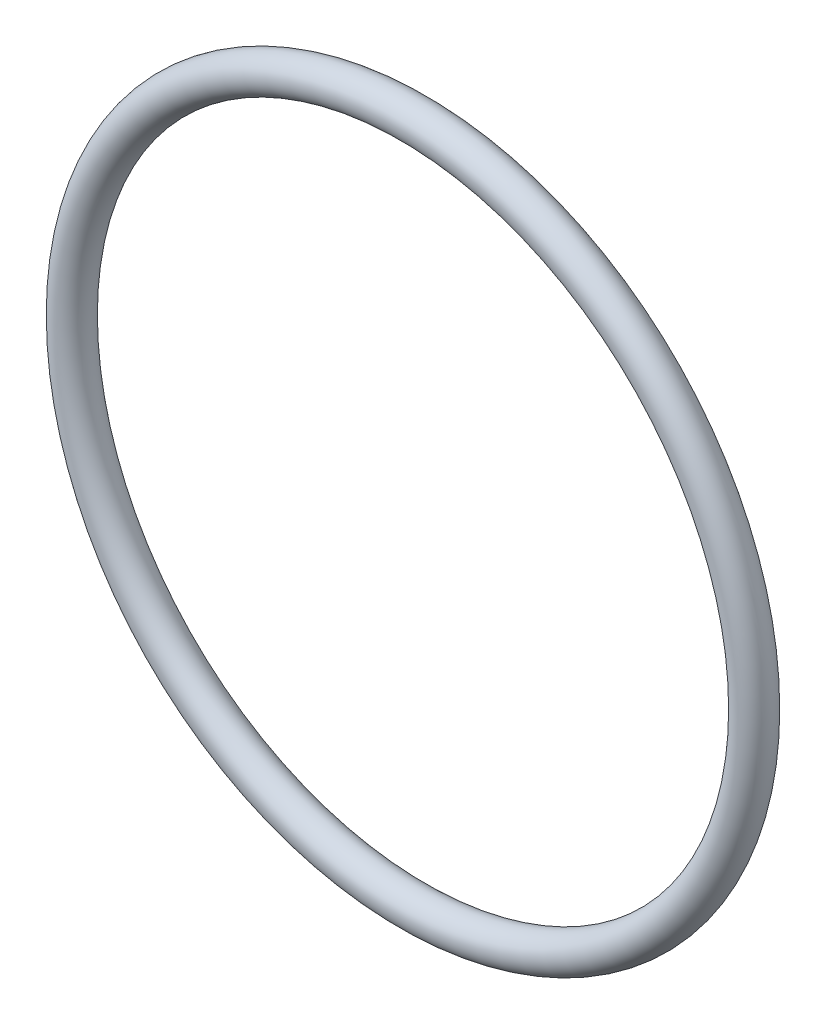
ISO-10303-21;
HEADER;
FILE_DESCRIPTION(('STEP AP214'),'2;1');
FILE_NAME('part.step','',(''),(''),'','','');
FILE_SCHEMA(('AUTOMOTIVE_DESIGN { 1 0 10303 214 1 1 1 1 }'));
ENDSEC;
DATA;
#1=APPLICATION_CONTEXT('core data for automotive mechanical design processes');
#2=APPLICATION_PROTOCOL_DEFINITION('international standard','automotive_design',2000,#1);
#3=PRODUCT_CONTEXT('',#1,'mechanical');
#4=PRODUCT('Part','Part','',(#3));
#5=PRODUCT_RELATED_PRODUCT_CATEGORY('part','',(#4));
#6=PRODUCT_DEFINITION_FORMATION('','',#4);
#7=PRODUCT_DEFINITION_CONTEXT('part definition',#1,'design');
#8=PRODUCT_DEFINITION('design','',#6,#7);
#9=PRODUCT_DEFINITION_SHAPE('','',#8);
#10=(LENGTH_UNIT() NAMED_UNIT(*) SI_UNIT(.MILLI.,.METRE.));
#11=(NAMED_UNIT(*) PLANE_ANGLE_UNIT() SI_UNIT($,.RADIAN.));
#12=(NAMED_UNIT(*) SI_UNIT($,.STERADIAN.) SOLID_ANGLE_UNIT());
#13=UNCERTAINTY_MEASURE_WITH_UNIT(LENGTH_MEASURE(1.E-05),#10,'distance_accuracy_value','');
#14=(GEOMETRIC_REPRESENTATION_CONTEXT(3) GLOBAL_UNCERTAINTY_ASSIGNED_CONTEXT((#13)) GLOBAL_UNIT_ASSIGNED_CONTEXT((#10,
#11,#12)) REPRESENTATION_CONTEXT('',''));
#15=CARTESIAN_POINT('',(0.,0.,0.));
#16=DIRECTION('',(0.,0.,1.));
#17=DIRECTION('',(1.,0.,0.));
#18=AXIS2_PLACEMENT_3D('',#15,#16,#17);
#19=CARTESIAN_POINT('',(0.,0.,0.));
#20=DIRECTION('',(0.,0.,1.));
#21=DIRECTION('',(1.,0.,0.));
#22=AXIS2_PLACEMENT_3D('',#19,#20,#21);
#23=TOROIDAL_SURFACE('',#22,33.3121,1.76530000000001);
#24=CARTESIAN_POINT('',(35.0774,0.,0.));
#25=VERTEX_POINT('',#24);
#26=VERTEX_LOOP('',#25);
#27=FACE_BOUND('',#26,.T.);
#28=ADVANCED_FACE('F32',(#27),#23,.T.);
#29=CLOSED_SHELL('',(#28));
#30=MANIFOLD_SOLID_BREP('B2',#29);
#31=ADVANCED_BREP_SHAPE_REPRESENTATION('',(#18,#30),#14);
#32=SHAPE_DEFINITION_REPRESENTATION(#9,#31);
ENDSEC;
END-ISO-10303-21;
